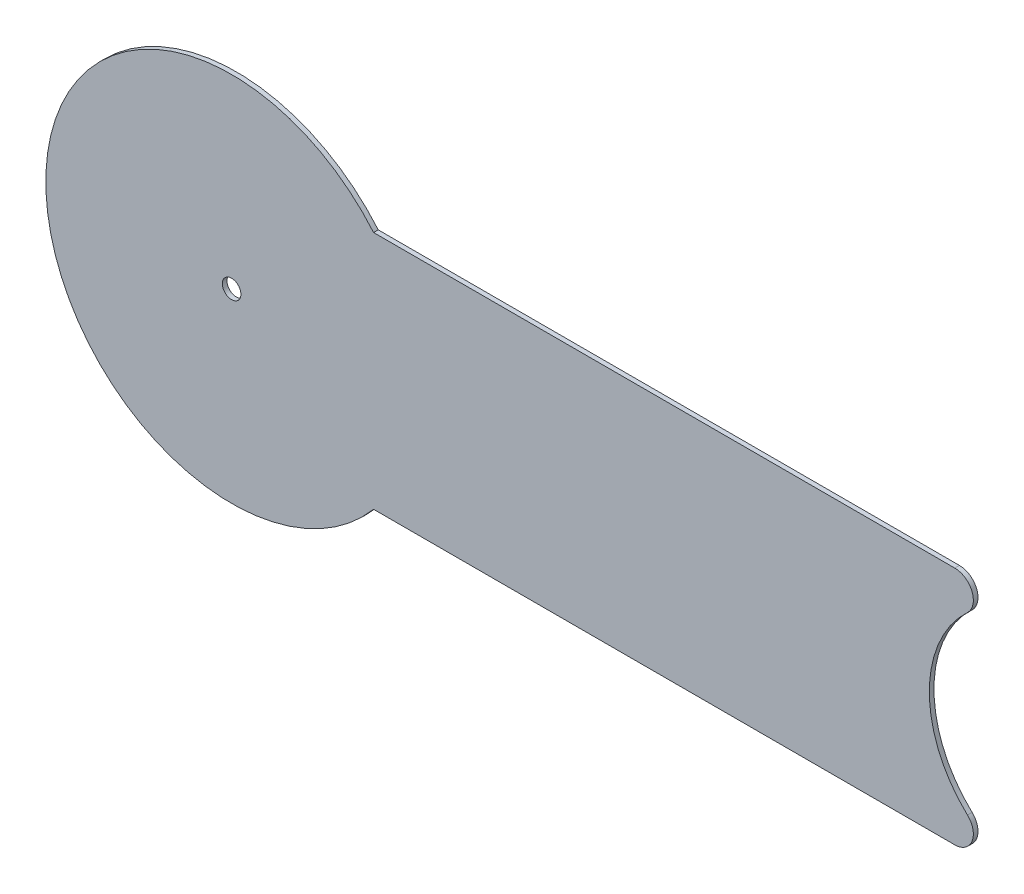
ISO-10303-21;
HEADER;
FILE_DESCRIPTION(('STEP AP214'),'2;1');
FILE_NAME('part.step','',(''),(''),'','','');
FILE_SCHEMA(('AUTOMOTIVE_DESIGN { 1 0 10303 214 1 1 1 1 }'));
ENDSEC;
DATA;
#1=APPLICATION_CONTEXT('core data for automotive mechanical design processes');
#2=APPLICATION_PROTOCOL_DEFINITION('international standard','automotive_design',2000,#1);
#3=PRODUCT_CONTEXT('',#1,'mechanical');
#4=PRODUCT('Part','Part','',(#3));
#5=PRODUCT_RELATED_PRODUCT_CATEGORY('part','',(#4));
#6=PRODUCT_DEFINITION_FORMATION('','',#4);
#7=PRODUCT_DEFINITION_CONTEXT('part definition',#1,'design');
#8=PRODUCT_DEFINITION('design','',#6,#7);
#9=PRODUCT_DEFINITION_SHAPE('','',#8);
#10=(LENGTH_UNIT() NAMED_UNIT(*) SI_UNIT(.MILLI.,.METRE.));
#11=(NAMED_UNIT(*) PLANE_ANGLE_UNIT() SI_UNIT($,.RADIAN.));
#12=(NAMED_UNIT(*) SI_UNIT($,.STERADIAN.) SOLID_ANGLE_UNIT());
#13=UNCERTAINTY_MEASURE_WITH_UNIT(LENGTH_MEASURE(1.E-05),#10,'distance_accuracy_value','');
#14=(GEOMETRIC_REPRESENTATION_CONTEXT(3) GLOBAL_UNCERTAINTY_ASSIGNED_CONTEXT((#13)) GLOBAL_UNIT_ASSIGNED_CONTEXT((#10,
#11,#12)) REPRESENTATION_CONTEXT('',''));
#15=CARTESIAN_POINT('',(0.,0.,0.));
#16=DIRECTION('',(0.,0.,1.));
#17=DIRECTION('',(1.,0.,0.));
#18=AXIS2_PLACEMENT_3D('',#15,#16,#17);
#19=CARTESIAN_POINT('',(247.146000248031,-34.6075,1.5875));
#20=DIRECTION('',(0.,0.,1.));
#21=DIRECTION('',(1.,0.,0.));
#22=AXIS2_PLACEMENT_3D('',#19,#20,#21);
#23=PLANE('',#22);
#24=CARTESIAN_POINT('',(247.146000248031,-34.6075,1.5875));
#25=DIRECTION('',(0.,0.,1.));
#26=DIRECTION('',(1.,0.,0.));
#27=AXIS2_PLACEMENT_3D('',#24,#25,#26);
#28=CIRCLE('',#27,6.35000000000001);
#29=CARTESIAN_POINT('',(247.146000248031,-40.9575,1.5875));
#30=VERTEX_POINT('',#29);
#31=CARTESIAN_POINT('',(251.475396187893,-29.9621979865772,1.5875));
#32=VERTEX_POINT('',#31);
#33=EDGE_CURVE('E129',#30,#32,#28,.T.);
#34=ORIENTED_EDGE('',*,*,#33,.T.);
#35=CARTESIAN_POINT('',(279.4,0.,1.5875));
#36=DIRECTION('',(0.,0.,-1.));
#37=DIRECTION('',(1.,0.,0.));
#38=AXIS2_PLACEMENT_3D('',#35,#36,#37);
#39=CIRCLE('',#38,40.9575);
#40=CARTESIAN_POINT('',(251.475396187893,29.9621979865772,1.5875));
#41=VERTEX_POINT('',#40);
#42=EDGE_CURVE('E87',#32,#41,#39,.T.);
#43=ORIENTED_EDGE('',*,*,#42,.T.);
#44=CARTESIAN_POINT('',(247.146000248031,34.6075,1.5875));
#45=DIRECTION('',(0.,0.,1.));
#46=DIRECTION('',(-1.,0.,0.));
#47=AXIS2_PLACEMENT_3D('',#44,#45,#46);
#48=CIRCLE('',#47,6.35000000000001);
#49=CARTESIAN_POINT('',(247.146000248031,40.9575,1.5875));
#50=VERTEX_POINT('',#49);
#51=EDGE_CURVE('E100',#41,#50,#48,.T.);
#52=ORIENTED_EDGE('',*,*,#51,.T.);
#53=DIRECTION('',(-1.,0.,0.));
#54=VECTOR('',#53,1.);
#55=CARTESIAN_POINT('',(247.146000248031,40.9575,1.5875));
#56=LINE('',#55,#54);
#57=CARTESIAN_POINT('',(48.5255931828762,40.9575,1.5875));
#58=VERTEX_POINT('',#57);
#59=EDGE_CURVE('E94',#50,#58,#56,.T.);
#60=ORIENTED_EDGE('',*,*,#59,.T.);
#61=CARTESIAN_POINT('',(0.,0.,1.5875));
#62=DIRECTION('',(0.,0.,1.));
#63=DIRECTION('',(1.,0.,0.));
#64=AXIS2_PLACEMENT_3D('',#61,#62,#63);
#65=CIRCLE('',#64,63.5);
#66=CARTESIAN_POINT('',(48.5255931828762,-40.9575,1.5875));
#67=VERTEX_POINT('',#66);
#68=EDGE_CURVE('E98',#58,#67,#65,.T.);
#69=ORIENTED_EDGE('',*,*,#68,.T.);
#70=DIRECTION('',(1.,0.,0.));
#71=VECTOR('',#70,1.);
#72=CARTESIAN_POINT('',(247.146000248031,-40.9575,1.5875));
#73=LINE('',#72,#71);
#74=EDGE_CURVE('E50',#67,#30,#73,.T.);
#75=ORIENTED_EDGE('',*,*,#74,.T.);
#76=EDGE_LOOP('',(#34,#43,#52,#60,#69,#75));
#77=FACE_BOUND('',#76,.T.);
#78=CARTESIAN_POINT('',(0.,0.,1.5875));
#79=DIRECTION('',(0.,0.,1.));
#80=DIRECTION('',(1.,0.,0.));
#81=AXIS2_PLACEMENT_3D('',#78,#79,#80);
#82=CIRCLE('',#81,3.175);
#83=CARTESIAN_POINT('',(3.175,0.,1.5875));
#84=VERTEX_POINT('',#83);
#85=EDGE_CURVE('E122',#84,#84,#82,.T.);
#86=ORIENTED_EDGE('',*,*,#85,.F.);
#87=EDGE_LOOP('',(#86));
#88=FACE_BOUND('',#87,.T.);
#89=ADVANCED_FACE('F33',(#77,#88),#23,.T.);
#90=CARTESIAN_POINT('',(247.146000248031,-34.6075,0.));
#91=DIRECTION('',(0.,0.,1.));
#92=DIRECTION('',(1.,0.,0.));
#93=AXIS2_PLACEMENT_3D('',#90,#91,#92);
#94=PLANE('',#93);
#95=CARTESIAN_POINT('',(247.146000248031,-34.6075,0.));
#96=DIRECTION('',(0.,0.,1.));
#97=DIRECTION('',(1.,0.,0.));
#98=AXIS2_PLACEMENT_3D('',#95,#96,#97);
#99=CIRCLE('',#98,6.35000000000001);
#100=CARTESIAN_POINT('',(247.146000248031,-40.9575,0.));
#101=VERTEX_POINT('',#100);
#102=CARTESIAN_POINT('',(251.475396187893,-29.9621979865772,0.));
#103=VERTEX_POINT('',#102);
#104=EDGE_CURVE('E118',#101,#103,#99,.T.);
#105=ORIENTED_EDGE('',*,*,#104,.F.);
#106=DIRECTION('',(1.,0.,0.));
#107=VECTOR('',#106,1.);
#108=CARTESIAN_POINT('',(247.146000248031,-40.9575,0.));
#109=LINE('',#108,#107);
#110=CARTESIAN_POINT('',(48.5255931828762,-40.9575,0.));
#111=VERTEX_POINT('',#110);
#112=EDGE_CURVE('E79',#111,#101,#109,.T.);
#113=ORIENTED_EDGE('',*,*,#112,.F.);
#114=CARTESIAN_POINT('',(0.,0.,0.));
#115=DIRECTION('',(0.,0.,1.));
#116=DIRECTION('',(1.,0.,0.));
#117=AXIS2_PLACEMENT_3D('',#114,#115,#116);
#118=CIRCLE('',#117,63.5);
#119=CARTESIAN_POINT('',(48.5255931828762,40.9575,0.));
#120=VERTEX_POINT('',#119);
#121=EDGE_CURVE('E73',#120,#111,#118,.T.);
#122=ORIENTED_EDGE('',*,*,#121,.F.);
#123=DIRECTION('',(-1.,0.,0.));
#124=VECTOR('',#123,1.);
#125=CARTESIAN_POINT('',(247.146000248031,40.9575,0.));
#126=LINE('',#125,#124);
#127=CARTESIAN_POINT('',(247.146000248031,40.9575,0.));
#128=VERTEX_POINT('',#127);
#129=EDGE_CURVE('E108',#128,#120,#126,.T.);
#130=ORIENTED_EDGE('',*,*,#129,.F.);
#131=CARTESIAN_POINT('',(247.146000248031,34.6075,0.));
#132=DIRECTION('',(0.,0.,1.));
#133=DIRECTION('',(-1.,0.,0.));
#134=AXIS2_PLACEMENT_3D('',#131,#132,#133);
#135=CIRCLE('',#134,6.35000000000001);
#136=CARTESIAN_POINT('',(251.475396187893,29.9621979865772,0.));
#137=VERTEX_POINT('',#136);
#138=EDGE_CURVE('E124',#137,#128,#135,.T.);
#139=ORIENTED_EDGE('',*,*,#138,.F.);
#140=CARTESIAN_POINT('',(279.4,0.,0.));
#141=DIRECTION('',(0.,0.,-1.));
#142=DIRECTION('',(1.,0.,0.));
#143=AXIS2_PLACEMENT_3D('',#140,#141,#142);
#144=CIRCLE('',#143,40.9575);
#145=EDGE_CURVE('E121',#103,#137,#144,.T.);
#146=ORIENTED_EDGE('',*,*,#145,.F.);
#147=EDGE_LOOP('',(#105,#113,#122,#130,#139,#146));
#148=FACE_BOUND('',#147,.T.);
#149=CARTESIAN_POINT('',(0.,0.,0.));
#150=DIRECTION('',(0.,0.,1.));
#151=DIRECTION('',(1.,0.,0.));
#152=AXIS2_PLACEMENT_3D('',#149,#150,#151);
#153=CIRCLE('',#152,3.175);
#154=CARTESIAN_POINT('',(3.175,0.,0.));
#155=VERTEX_POINT('',#154);
#156=EDGE_CURVE('E222',#155,#155,#153,.T.);
#157=ORIENTED_EDGE('',*,*,#156,.T.);
#158=EDGE_LOOP('',(#157));
#159=FACE_BOUND('',#158,.T.);
#160=ADVANCED_FACE('F138',(#148,#159),#94,.F.);
#161=CARTESIAN_POINT('',(247.146000248031,-34.6075,1.5875));
#162=DIRECTION('',(0.,0.,-1.));
#163=DIRECTION('',(-1.,0.,0.));
#164=AXIS2_PLACEMENT_3D('',#161,#162,#163);
#165=CYLINDRICAL_SURFACE('',#164,6.35000000000001);
#166=ORIENTED_EDGE('',*,*,#104,.T.);
#167=DIRECTION('',(0.,0.,-1.));
#168=VECTOR('',#167,1.);
#169=CARTESIAN_POINT('',(251.475396187893,-29.9621979865772,1.5875));
#170=LINE('',#169,#168);
#171=EDGE_CURVE('E11',#32,#103,#170,.T.);
#172=ORIENTED_EDGE('',*,*,#171,.F.);
#173=ORIENTED_EDGE('',*,*,#33,.F.);
#174=DIRECTION('',(0.,0.,-1.));
#175=VECTOR('',#174,1.);
#176=CARTESIAN_POINT('',(247.146000248031,-40.9575,1.5875));
#177=LINE('',#176,#175);
#178=EDGE_CURVE('E114',#30,#101,#177,.T.);
#179=ORIENTED_EDGE('',*,*,#178,.T.);
#180=EDGE_LOOP('',(#166,#172,#173,#179));
#181=FACE_BOUND('',#180,.T.);
#182=ADVANCED_FACE('F35',(#181),#165,.T.);
#183=CARTESIAN_POINT('',(279.4,0.,1.5875));
#184=DIRECTION('',(0.,0.,-1.));
#185=DIRECTION('',(-1.,0.,0.));
#186=AXIS2_PLACEMENT_3D('',#183,#184,#185);
#187=CYLINDRICAL_SURFACE('',#186,40.9575);
#188=ORIENTED_EDGE('',*,*,#145,.T.);
#189=DIRECTION('',(0.,0.,-1.));
#190=VECTOR('',#189,1.);
#191=CARTESIAN_POINT('',(251.475396187893,29.9621979865772,1.5875));
#192=LINE('',#191,#190);
#193=EDGE_CURVE('E42',#41,#137,#192,.T.);
#194=ORIENTED_EDGE('',*,*,#193,.F.);
#195=ORIENTED_EDGE('',*,*,#42,.F.);
#196=ORIENTED_EDGE('',*,*,#171,.T.);
#197=EDGE_LOOP('',(#188,#194,#195,#196));
#198=FACE_BOUND('',#197,.T.);
#199=ADVANCED_FACE('F163',(#198),#187,.F.);
#200=CARTESIAN_POINT('',(247.146000248031,34.6075,1.5875));
#201=DIRECTION('',(0.,0.,-1.));
#202=DIRECTION('',(-1.,0.,0.));
#203=AXIS2_PLACEMENT_3D('',#200,#201,#202);
#204=CYLINDRICAL_SURFACE('',#203,6.35000000000001);
#205=ORIENTED_EDGE('',*,*,#138,.T.);
#206=DIRECTION('',(0.,0.,-1.));
#207=VECTOR('',#206,1.);
#208=CARTESIAN_POINT('',(247.146000248031,40.9575,1.5875));
#209=LINE('',#208,#207);
#210=EDGE_CURVE('E109',#50,#128,#209,.T.);
#211=ORIENTED_EDGE('',*,*,#210,.F.);
#212=ORIENTED_EDGE('',*,*,#51,.F.);
#213=ORIENTED_EDGE('',*,*,#193,.T.);
#214=EDGE_LOOP('',(#205,#211,#212,#213));
#215=FACE_BOUND('',#214,.T.);
#216=ADVANCED_FACE('F135',(#215),#204,.T.);
#217=CARTESIAN_POINT('',(247.146000248031,40.9575,1.5875));
#218=DIRECTION('',(0.,-1.,0.));
#219=DIRECTION('',(1.,0.,0.));
#220=AXIS2_PLACEMENT_3D('',#217,#218,#219);
#221=PLANE('',#220);
#222=ORIENTED_EDGE('',*,*,#129,.T.);
#223=DIRECTION('',(0.,0.,-1.));
#224=VECTOR('',#223,1.);
#225=CARTESIAN_POINT('',(48.5255931828762,40.9575,1.5875));
#226=LINE('',#225,#224);
#227=EDGE_CURVE('E105',#58,#120,#226,.T.);
#228=ORIENTED_EDGE('',*,*,#227,.F.);
#229=ORIENTED_EDGE('',*,*,#59,.F.);
#230=ORIENTED_EDGE('',*,*,#210,.T.);
#231=EDGE_LOOP('',(#222,#228,#229,#230));
#232=FACE_BOUND('',#231,.T.);
#233=ADVANCED_FACE('F106',(#232),#221,.F.);
#234=CARTESIAN_POINT('',(0.,0.,1.5875));
#235=DIRECTION('',(0.,0.,-1.));
#236=DIRECTION('',(-1.,0.,0.));
#237=AXIS2_PLACEMENT_3D('',#234,#235,#236);
#238=CYLINDRICAL_SURFACE('',#237,63.5);
#239=ORIENTED_EDGE('',*,*,#121,.T.);
#240=DIRECTION('',(0.,0.,-1.));
#241=VECTOR('',#240,1.);
#242=CARTESIAN_POINT('',(48.5255931828762,-40.9575,1.5875));
#243=LINE('',#242,#241);
#244=EDGE_CURVE('E110',#67,#111,#243,.T.);
#245=ORIENTED_EDGE('',*,*,#244,.F.);
#246=ORIENTED_EDGE('',*,*,#68,.F.);
#247=ORIENTED_EDGE('',*,*,#227,.T.);
#248=EDGE_LOOP('',(#239,#245,#246,#247));
#249=FACE_BOUND('',#248,.T.);
#250=ADVANCED_FACE('F112',(#249),#238,.T.);
#251=CARTESIAN_POINT('',(247.146000248031,-40.9575,1.5875));
#252=DIRECTION('',(0.,1.,0.));
#253=DIRECTION('',(-1.,0.,0.));
#254=AXIS2_PLACEMENT_3D('',#251,#252,#253);
#255=PLANE('',#254);
#256=ORIENTED_EDGE('',*,*,#112,.T.);
#257=ORIENTED_EDGE('',*,*,#178,.F.);
#258=ORIENTED_EDGE('',*,*,#74,.F.);
#259=ORIENTED_EDGE('',*,*,#244,.T.);
#260=EDGE_LOOP('',(#256,#257,#258,#259));
#261=FACE_BOUND('',#260,.T.);
#262=ADVANCED_FACE('F143',(#261),#255,.F.);
#263=CARTESIAN_POINT('',(0.,0.,1.5875));
#264=DIRECTION('',(0.,0.,-1.));
#265=DIRECTION('',(-1.,0.,0.));
#266=AXIS2_PLACEMENT_3D('',#263,#264,#265);
#267=CYLINDRICAL_SURFACE('',#266,3.175);
#268=ORIENTED_EDGE('',*,*,#85,.T.);
#269=EDGE_LOOP('',(#268));
#270=FACE_BOUND('',#269,.T.);
#271=ORIENTED_EDGE('',*,*,#156,.F.);
#272=EDGE_LOOP('',(#271));
#273=FACE_BOUND('',#272,.T.);
#274=ADVANCED_FACE('F145',(#270,#273),#267,.F.);
#275=CLOSED_SHELL('',(#89,#160,#182,#199,#216,#233,#250,#262,#274));
#276=MANIFOLD_SOLID_BREP('B2',#275);
#277=ADVANCED_BREP_SHAPE_REPRESENTATION('',(#18,#276),#14);
#278=SHAPE_DEFINITION_REPRESENTATION(#9,#277);
ENDSEC;
END-ISO-10303-21;
